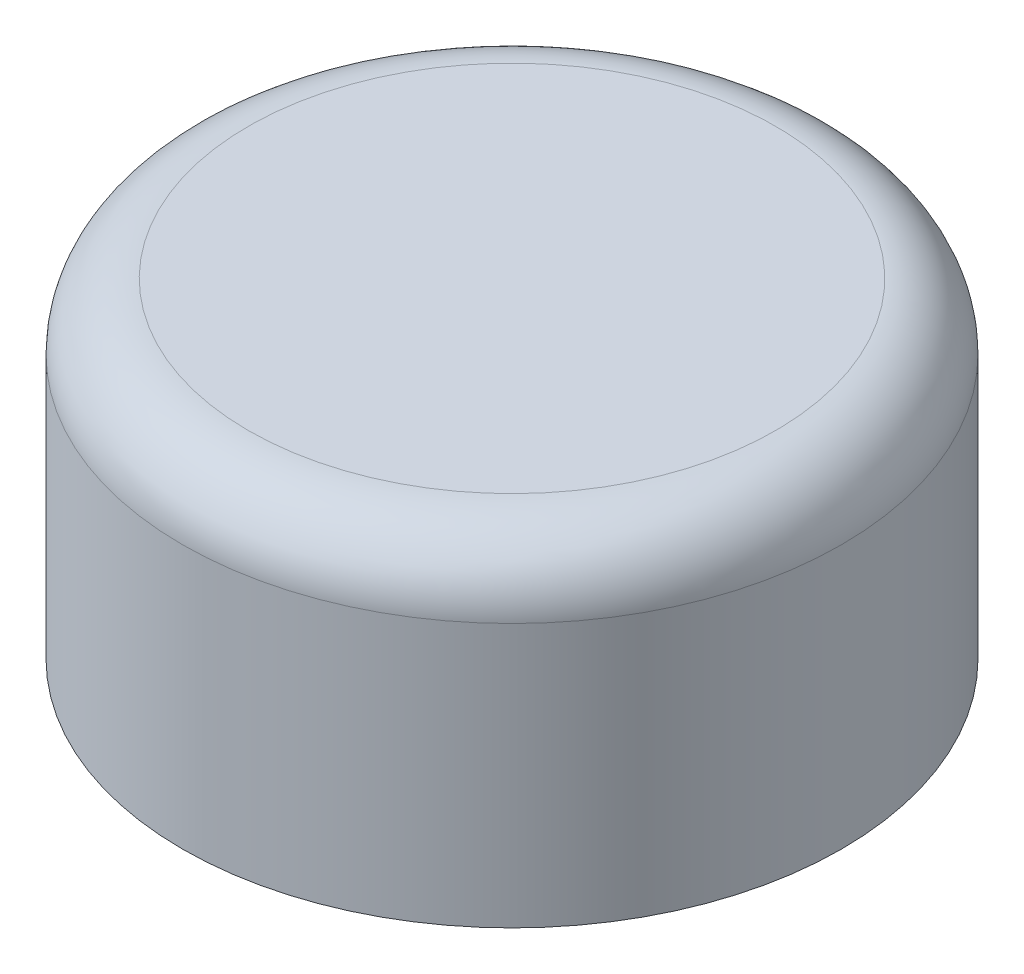
ISO-10303-21;
HEADER;
FILE_DESCRIPTION(('STEP AP214'),'2;1');
FILE_NAME('part.step','',(''),(''),'','','');
FILE_SCHEMA(('AUTOMOTIVE_DESIGN { 1 0 10303 214 1 1 1 1 }'));
ENDSEC;
DATA;
#1=APPLICATION_CONTEXT('core data for automotive mechanical design processes');
#2=APPLICATION_PROTOCOL_DEFINITION('international standard','automotive_design',2000,#1);
#3=PRODUCT_CONTEXT('',#1,'mechanical');
#4=PRODUCT('Part','Part','',(#3));
#5=PRODUCT_RELATED_PRODUCT_CATEGORY('part','',(#4));
#6=PRODUCT_DEFINITION_FORMATION('','',#4);
#7=PRODUCT_DEFINITION_CONTEXT('part definition',#1,'design');
#8=PRODUCT_DEFINITION('design','',#6,#7);
#9=PRODUCT_DEFINITION_SHAPE('','',#8);
#10=(LENGTH_UNIT() NAMED_UNIT(*) SI_UNIT(.MILLI.,.METRE.));
#11=(NAMED_UNIT(*) PLANE_ANGLE_UNIT() SI_UNIT($,.RADIAN.));
#12=(NAMED_UNIT(*) SI_UNIT($,.STERADIAN.) SOLID_ANGLE_UNIT());
#13=UNCERTAINTY_MEASURE_WITH_UNIT(LENGTH_MEASURE(1.E-05),#10,'distance_accuracy_value','');
#14=(GEOMETRIC_REPRESENTATION_CONTEXT(3) GLOBAL_UNCERTAINTY_ASSIGNED_CONTEXT((#13)) GLOBAL_UNIT_ASSIGNED_CONTEXT((#10,
#11,#12)) REPRESENTATION_CONTEXT('',''));
#15=CARTESIAN_POINT('',(0.,0.,0.));
#16=DIRECTION('',(0.,0.,1.));
#17=DIRECTION('',(1.,0.,0.));
#18=AXIS2_PLACEMENT_3D('',#15,#16,#17);
#19=CARTESIAN_POINT('',(0.,5.,0.));
#20=DIRECTION('',(0.,-1.,0.));
#21=DIRECTION('',(0.,0.,-1.));
#22=AXIS2_PLACEMENT_3D('',#19,#20,#21);
#23=CYLINDRICAL_SURFACE('',#22,5.);
#24=CARTESIAN_POINT('',(0.,4.,0.));
#25=DIRECTION('',(0.,1.,0.));
#26=DIRECTION('',(0.,0.,1.));
#27=AXIS2_PLACEMENT_3D('',#24,#25,#26);
#28=CIRCLE('',#27,5.);
#29=CARTESIAN_POINT('',(0.,4.,5.));
#30=VERTEX_POINT('',#29);
#31=EDGE_CURVE('E10',#30,#30,#28,.F.);
#32=ORIENTED_EDGE('',*,*,#31,.T.);
#33=EDGE_LOOP('',(#32));
#34=FACE_BOUND('',#33,.T.);
#35=CARTESIAN_POINT('',(0.,0.,0.));
#36=DIRECTION('',(0.,1.,0.));
#37=DIRECTION('',(0.,0.,1.));
#38=AXIS2_PLACEMENT_3D('',#35,#36,#37);
#39=CIRCLE('',#38,5.);
#40=CARTESIAN_POINT('',(0.,0.,5.));
#41=VERTEX_POINT('',#40);
#42=EDGE_CURVE('E43',#41,#41,#39,.T.);
#43=ORIENTED_EDGE('',*,*,#42,.T.);
#44=EDGE_LOOP('',(#43));
#45=FACE_BOUND('',#44,.T.);
#46=ADVANCED_FACE('F32',(#34,#45),#23,.T.);
#47=CARTESIAN_POINT('',(0.,5.,0.));
#48=DIRECTION('',(0.,1.,0.));
#49=DIRECTION('',(0.,0.,1.));
#50=AXIS2_PLACEMENT_3D('',#47,#48,#49);
#51=PLANE('',#50);
#52=CARTESIAN_POINT('',(0.,5.,0.));
#53=DIRECTION('',(0.,1.,0.));
#54=DIRECTION('',(0.,0.,1.));
#55=AXIS2_PLACEMENT_3D('',#52,#53,#54);
#56=CIRCLE('',#55,4.);
#57=CARTESIAN_POINT('',(0.,5.,4.));
#58=VERTEX_POINT('',#57);
#59=EDGE_CURVE('E39',#58,#58,#56,.T.);
#60=ORIENTED_EDGE('',*,*,#59,.T.);
#61=EDGE_LOOP('',(#60));
#62=FACE_BOUND('',#61,.T.);
#63=ADVANCED_FACE('F67',(#62),#51,.T.);
#64=CARTESIAN_POINT('',(0.,0.,0.));
#65=DIRECTION('',(0.,1.,0.));
#66=DIRECTION('',(0.,0.,1.));
#67=AXIS2_PLACEMENT_3D('',#64,#65,#66);
#68=PLANE('',#67);
#69=CARTESIAN_POINT('',(0.,0.,0.));
#70=DIRECTION('',(0.,-1.,0.));
#71=DIRECTION('',(0.,0.,-1.));
#72=AXIS2_PLACEMENT_3D('',#69,#70,#71);
#73=CIRCLE('',#72,3.7);
#74=CARTESIAN_POINT('',(0.,0.,-3.7));
#75=VERTEX_POINT('',#74);
#76=EDGE_CURVE('E50',#75,#75,#73,.T.);
#77=ORIENTED_EDGE('',*,*,#76,.F.);
#78=EDGE_LOOP('',(#77));
#79=FACE_BOUND('',#78,.T.);
#80=ORIENTED_EDGE('',*,*,#42,.F.);
#81=EDGE_LOOP('',(#80));
#82=FACE_BOUND('',#81,.T.);
#83=ADVANCED_FACE('F64',(#79,#82),#68,.F.);
#84=CARTESIAN_POINT('',(0.,4.,0.));
#85=DIRECTION('',(0.,1.,0.));
#86=DIRECTION('',(0.,0.,1.));
#87=AXIS2_PLACEMENT_3D('',#84,#85,#86);
#88=TOROIDAL_SURFACE('',#87,4.,1.);
#89=ORIENTED_EDGE('',*,*,#31,.F.);
#90=EDGE_LOOP('',(#89));
#91=FACE_BOUND('',#90,.T.);
#92=ORIENTED_EDGE('',*,*,#59,.F.);
#93=EDGE_LOOP('',(#92));
#94=FACE_BOUND('',#93,.T.);
#95=ADVANCED_FACE('F34',(#91,#94),#88,.T.);
#96=CARTESIAN_POINT('',(0.,2.,0.));
#97=DIRECTION('',(0.,-1.,0.));
#98=DIRECTION('',(0.,0.,-1.));
#99=AXIS2_PLACEMENT_3D('',#96,#97,#98);
#100=CYLINDRICAL_SURFACE('',#99,3.7);
#101=CARTESIAN_POINT('',(0.,2.,0.));
#102=DIRECTION('',(0.,-1.,0.));
#103=DIRECTION('',(0.,0.,-1.));
#104=AXIS2_PLACEMENT_3D('',#101,#102,#103);
#105=CIRCLE('',#104,3.7);
#106=CARTESIAN_POINT('',(0.,2.,-3.7));
#107=VERTEX_POINT('',#106);
#108=EDGE_CURVE('E47',#107,#107,#105,.T.);
#109=ORIENTED_EDGE('',*,*,#108,.F.);
#110=EDGE_LOOP('',(#109));
#111=FACE_BOUND('',#110,.T.);
#112=ORIENTED_EDGE('',*,*,#76,.T.);
#113=EDGE_LOOP('',(#112));
#114=FACE_BOUND('',#113,.T.);
#115=ADVANCED_FACE('F58',(#111,#114),#100,.F.);
#116=CARTESIAN_POINT('',(0.,2.,0.));
#117=DIRECTION('',(0.,-1.,0.));
#118=DIRECTION('',(0.,0.,-1.));
#119=AXIS2_PLACEMENT_3D('',#116,#117,#118);
#120=PLANE('',#119);
#121=ORIENTED_EDGE('',*,*,#108,.T.);
#122=EDGE_LOOP('',(#121));
#123=FACE_BOUND('',#122,.T.);
#124=ADVANCED_FACE('F56',(#123),#120,.T.);
#125=CLOSED_SHELL('',(#46,#63,#83,#95,#115,#124));
#126=MANIFOLD_SOLID_BREP('B2',#125);
#127=ADVANCED_BREP_SHAPE_REPRESENTATION('',(#18,#126),#14);
#128=SHAPE_DEFINITION_REPRESENTATION(#9,#127);
ENDSEC;
END-ISO-10303-21;
